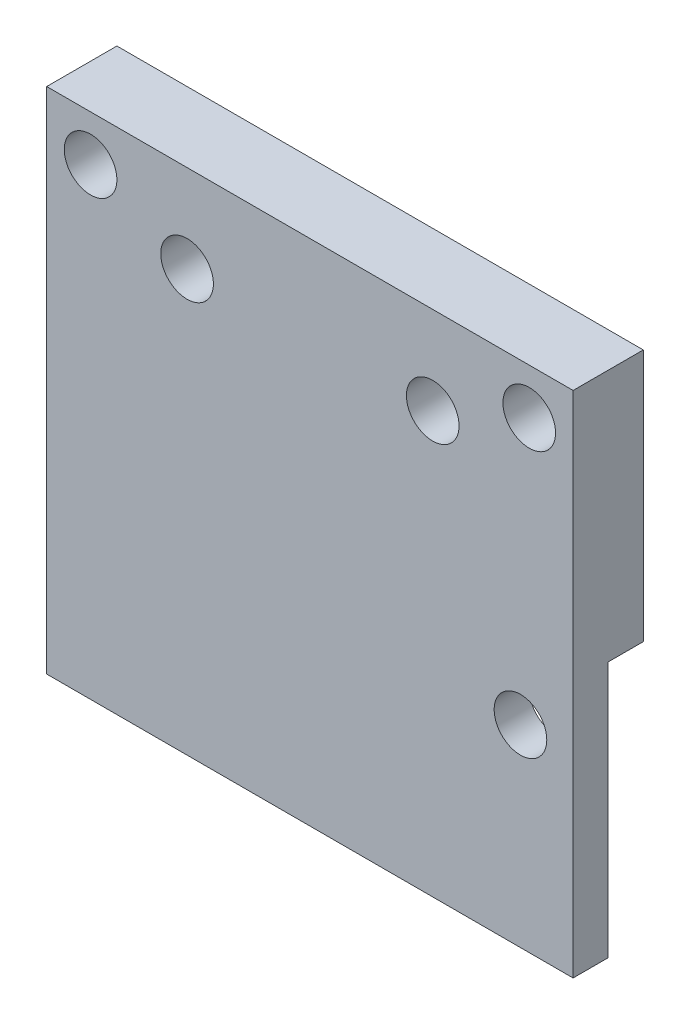
ISO-10303-21;
HEADER;
FILE_DESCRIPTION(('STEP AP214'),'2;1');
FILE_NAME('part.step','',(''),(''),'','','');
FILE_SCHEMA(('AUTOMOTIVE_DESIGN { 1 0 10303 214 1 1 1 1 }'));
ENDSEC;
DATA;
#1=APPLICATION_CONTEXT('core data for automotive mechanical design processes');
#2=APPLICATION_PROTOCOL_DEFINITION('international standard','automotive_design',2000,#1);
#3=PRODUCT_CONTEXT('',#1,'mechanical');
#4=PRODUCT('Part','Part','',(#3));
#5=PRODUCT_RELATED_PRODUCT_CATEGORY('part','',(#4));
#6=PRODUCT_DEFINITION_FORMATION('','',#4);
#7=PRODUCT_DEFINITION_CONTEXT('part definition',#1,'design');
#8=PRODUCT_DEFINITION('design','',#6,#7);
#9=PRODUCT_DEFINITION_SHAPE('','',#8);
#10=(LENGTH_UNIT() NAMED_UNIT(*) SI_UNIT(.MILLI.,.METRE.));
#11=(NAMED_UNIT(*) PLANE_ANGLE_UNIT() SI_UNIT($,.RADIAN.));
#12=(NAMED_UNIT(*) SI_UNIT($,.STERADIAN.) SOLID_ANGLE_UNIT());
#13=UNCERTAINTY_MEASURE_WITH_UNIT(LENGTH_MEASURE(1.E-05),#10,'distance_accuracy_value','');
#14=(GEOMETRIC_REPRESENTATION_CONTEXT(3) GLOBAL_UNCERTAINTY_ASSIGNED_CONTEXT((#13)) GLOBAL_UNIT_ASSIGNED_CONTEXT((#10,
#11,#12)) REPRESENTATION_CONTEXT('',''));
#15=CARTESIAN_POINT('',(0.,0.,0.));
#16=DIRECTION('',(0.,0.,1.));
#17=DIRECTION('',(1.,0.,0.));
#18=AXIS2_PLACEMENT_3D('',#15,#16,#17);
#19=CARTESIAN_POINT('',(0.,-6.5,4.));
#20=DIRECTION('',(0.,-1.,0.));
#21=DIRECTION('',(1.,0.,0.));
#22=AXIS2_PLACEMENT_3D('',#19,#20,#21);
#23=PLANE('',#22);
#24=DIRECTION('',(0.,0.,-1.));
#25=VECTOR('',#24,1.);
#26=CARTESIAN_POINT('',(-15.,-6.5,4.));
#27=LINE('',#26,#25);
#28=CARTESIAN_POINT('',(-15.,-6.5,4.));
#29=VERTEX_POINT('',#28);
#30=CARTESIAN_POINT('',(-15.,-6.5,2.));
#31=VERTEX_POINT('',#30);
#32=EDGE_CURVE('E59',#29,#31,#27,.T.);
#33=ORIENTED_EDGE('',*,*,#32,.T.);
#34=DIRECTION('',(-1.,0.,0.));
#35=VECTOR('',#34,1.);
#36=CARTESIAN_POINT('',(15.,-6.5,2.));
#37=LINE('',#36,#35);
#38=CARTESIAN_POINT('',(15.,-6.5,2.));
#39=VERTEX_POINT('',#38);
#40=EDGE_CURVE('E101',#39,#31,#37,.T.);
#41=ORIENTED_EDGE('',*,*,#40,.F.);
#42=DIRECTION('',(0.,0.,-1.));
#43=VECTOR('',#42,1.);
#44=CARTESIAN_POINT('',(15.,-6.5,4.));
#45=LINE('',#44,#43);
#46=CARTESIAN_POINT('',(15.,-6.5,4.));
#47=VERTEX_POINT('',#46);
#48=EDGE_CURVE('E11',#47,#39,#45,.T.);
#49=ORIENTED_EDGE('',*,*,#48,.F.);
#50=DIRECTION('',(-1.,0.,0.));
#51=VECTOR('',#50,1.);
#52=CARTESIAN_POINT('',(0.,-6.5,4.));
#53=LINE('',#52,#51);
#54=EDGE_CURVE('E118',#47,#29,#53,.T.);
#55=ORIENTED_EDGE('',*,*,#54,.T.);
#56=EDGE_LOOP('',(#33,#41,#49,#55));
#57=FACE_BOUND('',#56,.T.);
#58=ADVANCED_FACE('F35',(#57),#23,.T.);
#59=CARTESIAN_POINT('',(12.,4.5,4.));
#60=DIRECTION('',(0.,0.,-1.));
#61=DIRECTION('',(-1.,0.,0.));
#62=AXIS2_PLACEMENT_3D('',#59,#60,#61);
#63=CYLINDRICAL_SURFACE('',#62,1.5);
#64=CARTESIAN_POINT('',(12.,4.5,4.));
#65=DIRECTION('',(0.,0.,1.));
#66=DIRECTION('',(1.,0.,0.));
#67=AXIS2_PLACEMENT_3D('',#64,#65,#66);
#68=CIRCLE('',#67,1.5);
#69=CARTESIAN_POINT('',(13.5,4.5,4.));
#70=VERTEX_POINT('',#69);
#71=EDGE_CURVE('E123',#70,#70,#68,.T.);
#72=ORIENTED_EDGE('',*,*,#71,.T.);
#73=EDGE_LOOP('',(#72));
#74=FACE_BOUND('',#73,.T.);
#75=CARTESIAN_POINT('',(12.,4.5,2.));
#76=DIRECTION('',(0.,0.,-1.));
#77=DIRECTION('',(-1.,0.,0.));
#78=AXIS2_PLACEMENT_3D('',#75,#76,#77);
#79=CIRCLE('',#78,1.5);
#80=CARTESIAN_POINT('',(10.5,4.5,2.));
#81=VERTEX_POINT('',#80);
#82=EDGE_CURVE('E136',#81,#81,#79,.T.);
#83=ORIENTED_EDGE('',*,*,#82,.T.);
#84=EDGE_LOOP('',(#83));
#85=FACE_BOUND('',#84,.T.);
#86=ADVANCED_FACE('F186',(#74,#85),#63,.F.);
#87=CARTESIAN_POINT('',(15.,0.,4.));
#88=DIRECTION('',(-1.,0.,0.));
#89=DIRECTION('',(0.,-1.,0.));
#90=AXIS2_PLACEMENT_3D('',#87,#88,#89);
#91=PLANE('',#90);
#92=DIRECTION('',(0.,-1.,0.));
#93=VECTOR('',#92,1.);
#94=CARTESIAN_POINT('',(15.,8.1,2.));
#95=LINE('',#94,#93);
#96=CARTESIAN_POINT('',(15.,8.1,2.));
#97=VERTEX_POINT('',#96);
#98=EDGE_CURVE('E99',#97,#39,#95,.T.);
#99=ORIENTED_EDGE('',*,*,#98,.F.);
#100=DIRECTION('',(0.,0.,-1.));
#101=VECTOR('',#100,1.);
#102=CARTESIAN_POINT('',(15.,8.1,2.));
#103=LINE('',#102,#101);
#104=CARTESIAN_POINT('',(15.,8.1,0.));
#105=VERTEX_POINT('',#104);
#106=EDGE_CURVE('E158',#97,#105,#103,.T.);
#107=ORIENTED_EDGE('',*,*,#106,.T.);
#108=DIRECTION('',(0.,1.,0.));
#109=VECTOR('',#108,1.);
#110=CARTESIAN_POINT('',(15.,0.,0.));
#111=LINE('',#110,#109);
#112=CARTESIAN_POINT('',(15.,22.5,0.));
#113=VERTEX_POINT('',#112);
#114=EDGE_CURVE('E145',#105,#113,#111,.T.);
#115=ORIENTED_EDGE('',*,*,#114,.T.);
#116=DIRECTION('',(0.,0.,-1.));
#117=VECTOR('',#116,1.);
#118=CARTESIAN_POINT('',(15.,22.5,4.));
#119=LINE('',#118,#117);
#120=CARTESIAN_POINT('',(15.,22.5,4.));
#121=VERTEX_POINT('',#120);
#122=EDGE_CURVE('E43',#121,#113,#119,.T.);
#123=ORIENTED_EDGE('',*,*,#122,.F.);
#124=DIRECTION('',(0.,1.,0.));
#125=VECTOR('',#124,1.);
#126=CARTESIAN_POINT('',(15.,0.,4.));
#127=LINE('',#126,#125);
#128=EDGE_CURVE('E111',#47,#121,#127,.T.);
#129=ORIENTED_EDGE('',*,*,#128,.F.);
#130=ORIENTED_EDGE('',*,*,#48,.T.);
#131=EDGE_LOOP('',(#99,#107,#115,#123,#129,#130));
#132=FACE_BOUND('',#131,.T.);
#133=ADVANCED_FACE('F109',(#132),#91,.F.);
#134=CARTESIAN_POINT('',(0.,22.5,4.));
#135=DIRECTION('',(0.,1.,0.));
#136=DIRECTION('',(-1.,0.,0.));
#137=AXIS2_PLACEMENT_3D('',#134,#135,#136);
#138=PLANE('',#137);
#139=DIRECTION('',(1.,0.,0.));
#140=VECTOR('',#139,1.);
#141=CARTESIAN_POINT('',(0.,22.5,0.));
#142=LINE('',#141,#140);
#143=CARTESIAN_POINT('',(-15.,22.5,0.));
#144=VERTEX_POINT('',#143);
#145=EDGE_CURVE('E147',#144,#113,#142,.T.);
#146=ORIENTED_EDGE('',*,*,#145,.F.);
#147=DIRECTION('',(0.,0.,-1.));
#148=VECTOR('',#147,1.);
#149=CARTESIAN_POINT('',(-15.,22.5,4.));
#150=LINE('',#149,#148);
#151=CARTESIAN_POINT('',(-15.,22.5,4.));
#152=VERTEX_POINT('',#151);
#153=EDGE_CURVE('E152',#152,#144,#150,.T.);
#154=ORIENTED_EDGE('',*,*,#153,.F.);
#155=DIRECTION('',(1.,0.,0.));
#156=VECTOR('',#155,1.);
#157=CARTESIAN_POINT('',(0.,22.5,4.));
#158=LINE('',#157,#156);
#159=EDGE_CURVE('E117',#152,#121,#158,.T.);
#160=ORIENTED_EDGE('',*,*,#159,.T.);
#161=ORIENTED_EDGE('',*,*,#122,.T.);
#162=EDGE_LOOP('',(#146,#154,#160,#161));
#163=FACE_BOUND('',#162,.T.);
#164=ADVANCED_FACE('F155',(#163),#138,.T.);
#165=CARTESIAN_POINT('',(-12.5,19.8979157616564,4.));
#166=DIRECTION('',(0.,0.,-1.));
#167=DIRECTION('',(-1.,0.,0.));
#168=AXIS2_PLACEMENT_3D('',#165,#166,#167);
#169=CYLINDRICAL_SURFACE('',#168,1.5);
#170=CARTESIAN_POINT('',(-12.5,19.8979157616564,4.));
#171=DIRECTION('',(0.,0.,1.));
#172=DIRECTION('',(1.,0.,0.));
#173=AXIS2_PLACEMENT_3D('',#170,#171,#172);
#174=CIRCLE('',#173,1.5);
#175=CARTESIAN_POINT('',(-11.,19.8979157616564,4.));
#176=VERTEX_POINT('',#175);
#177=EDGE_CURVE('E126',#176,#176,#174,.T.);
#178=ORIENTED_EDGE('',*,*,#177,.T.);
#179=EDGE_LOOP('',(#178));
#180=FACE_BOUND('',#179,.T.);
#181=CARTESIAN_POINT('',(-12.5,19.8979157616564,0.));
#182=DIRECTION('',(0.,0.,1.));
#183=DIRECTION('',(1.,0.,0.));
#184=AXIS2_PLACEMENT_3D('',#181,#182,#183);
#185=CIRCLE('',#184,1.5);
#186=CARTESIAN_POINT('',(-11.,19.8979157616564,0.));
#187=VERTEX_POINT('',#186);
#188=EDGE_CURVE('E142',#187,#187,#185,.T.);
#189=ORIENTED_EDGE('',*,*,#188,.F.);
#190=EDGE_LOOP('',(#189));
#191=FACE_BOUND('',#190,.T.);
#192=ADVANCED_FACE('F176',(#180,#191),#169,.F.);
#193=CARTESIAN_POINT('',(12.5,19.8979157616564,4.));
#194=DIRECTION('',(0.,0.,-1.));
#195=DIRECTION('',(-1.,0.,0.));
#196=AXIS2_PLACEMENT_3D('',#193,#194,#195);
#197=CYLINDRICAL_SURFACE('',#196,1.5);
#198=CARTESIAN_POINT('',(12.5,19.8979157616564,4.));
#199=DIRECTION('',(0.,0.,1.));
#200=DIRECTION('',(1.,0.,0.));
#201=AXIS2_PLACEMENT_3D('',#198,#199,#200);
#202=CIRCLE('',#201,1.5);
#203=CARTESIAN_POINT('',(14.,19.8979157616564,4.));
#204=VERTEX_POINT('',#203);
#205=EDGE_CURVE('E171',#204,#204,#202,.T.);
#206=ORIENTED_EDGE('',*,*,#205,.T.);
#207=EDGE_LOOP('',(#206));
#208=FACE_BOUND('',#207,.T.);
#209=CARTESIAN_POINT('',(12.5,19.8979157616564,0.));
#210=DIRECTION('',(0.,0.,1.));
#211=DIRECTION('',(1.,0.,0.));
#212=AXIS2_PLACEMENT_3D('',#209,#210,#211);
#213=CIRCLE('',#212,1.5);
#214=CARTESIAN_POINT('',(14.,19.8979157616564,0.));
#215=VERTEX_POINT('',#214);
#216=EDGE_CURVE('E139',#215,#215,#213,.T.);
#217=ORIENTED_EDGE('',*,*,#216,.F.);
#218=EDGE_LOOP('',(#217));
#219=FACE_BOUND('',#218,.T.);
#220=ADVANCED_FACE('F208',(#208,#219),#197,.F.);
#221=CARTESIAN_POINT('',(-7.,17.5,4.));
#222=DIRECTION('',(0.,0.,-1.));
#223=DIRECTION('',(-1.,0.,0.));
#224=AXIS2_PLACEMENT_3D('',#221,#222,#223);
#225=CYLINDRICAL_SURFACE('',#224,1.5);
#226=CARTESIAN_POINT('',(-7.,17.5,4.));
#227=DIRECTION('',(0.,0.,1.));
#228=DIRECTION('',(1.,0.,0.));
#229=AXIS2_PLACEMENT_3D('',#226,#227,#228);
#230=CIRCLE('',#229,1.5);
#231=CARTESIAN_POINT('',(-5.5,17.5,4.));
#232=VERTEX_POINT('',#231);
#233=EDGE_CURVE('E168',#232,#232,#230,.T.);
#234=ORIENTED_EDGE('',*,*,#233,.T.);
#235=EDGE_LOOP('',(#234));
#236=FACE_BOUND('',#235,.T.);
#237=CARTESIAN_POINT('',(-7.,17.5,0.));
#238=DIRECTION('',(0.,0.,1.));
#239=DIRECTION('',(1.,0.,0.));
#240=AXIS2_PLACEMENT_3D('',#237,#238,#239);
#241=CIRCLE('',#240,1.5);
#242=CARTESIAN_POINT('',(-5.5,17.5,0.));
#243=VERTEX_POINT('',#242);
#244=EDGE_CURVE('E135',#243,#243,#241,.T.);
#245=ORIENTED_EDGE('',*,*,#244,.F.);
#246=EDGE_LOOP('',(#245));
#247=FACE_BOUND('',#246,.T.);
#248=ADVANCED_FACE('F210',(#236,#247),#225,.F.);
#249=CARTESIAN_POINT('',(7.,17.5,4.));
#250=DIRECTION('',(0.,0.,-1.));
#251=DIRECTION('',(-1.,0.,0.));
#252=AXIS2_PLACEMENT_3D('',#249,#250,#251);
#253=CYLINDRICAL_SURFACE('',#252,1.5);
#254=CARTESIAN_POINT('',(7.,17.5,4.));
#255=DIRECTION('',(0.,0.,1.));
#256=DIRECTION('',(1.,0.,0.));
#257=AXIS2_PLACEMENT_3D('',#254,#255,#256);
#258=CIRCLE('',#257,1.5);
#259=CARTESIAN_POINT('',(8.5,17.5,4.));
#260=VERTEX_POINT('',#259);
#261=EDGE_CURVE('E150',#260,#260,#258,.T.);
#262=ORIENTED_EDGE('',*,*,#261,.T.);
#263=EDGE_LOOP('',(#262));
#264=FACE_BOUND('',#263,.T.);
#265=CARTESIAN_POINT('',(7.,17.5,0.));
#266=DIRECTION('',(0.,0.,1.));
#267=DIRECTION('',(1.,0.,0.));
#268=AXIS2_PLACEMENT_3D('',#265,#266,#267);
#269=CIRCLE('',#268,1.5);
#270=CARTESIAN_POINT('',(8.5,17.5,0.));
#271=VERTEX_POINT('',#270);
#272=EDGE_CURVE('E132',#271,#271,#269,.T.);
#273=ORIENTED_EDGE('',*,*,#272,.F.);
#274=EDGE_LOOP('',(#273));
#275=FACE_BOUND('',#274,.T.);
#276=ADVANCED_FACE('F37',(#264,#275),#253,.F.);
#277=CARTESIAN_POINT('',(-15.,0.,4.));
#278=DIRECTION('',(-1.,0.,0.));
#279=DIRECTION('',(0.,-1.,0.));
#280=AXIS2_PLACEMENT_3D('',#277,#278,#279);
#281=PLANE('',#280);
#282=DIRECTION('',(0.,0.,-1.));
#283=VECTOR('',#282,1.);
#284=CARTESIAN_POINT('',(-15.,8.1,2.));
#285=LINE('',#284,#283);
#286=CARTESIAN_POINT('',(-15.,8.1,2.));
#287=VERTEX_POINT('',#286);
#288=CARTESIAN_POINT('',(-15.,8.1,0.));
#289=VERTEX_POINT('',#288);
#290=EDGE_CURVE('E50',#287,#289,#285,.T.);
#291=ORIENTED_EDGE('',*,*,#290,.F.);
#292=DIRECTION('',(0.,1.,0.));
#293=VECTOR('',#292,1.);
#294=CARTESIAN_POINT('',(-15.,8.1,2.));
#295=LINE('',#294,#293);
#296=EDGE_CURVE('E107',#31,#287,#295,.T.);
#297=ORIENTED_EDGE('',*,*,#296,.F.);
#298=ORIENTED_EDGE('',*,*,#32,.F.);
#299=DIRECTION('',(0.,1.,0.));
#300=VECTOR('',#299,1.);
#301=CARTESIAN_POINT('',(-15.,0.,4.));
#302=LINE('',#301,#300);
#303=EDGE_CURVE('E122',#29,#152,#302,.T.);
#304=ORIENTED_EDGE('',*,*,#303,.T.);
#305=ORIENTED_EDGE('',*,*,#153,.T.);
#306=DIRECTION('',(0.,1.,0.));
#307=VECTOR('',#306,1.);
#308=CARTESIAN_POINT('',(-15.,0.,0.));
#309=LINE('',#308,#307);
#310=EDGE_CURVE('E75',#289,#144,#309,.T.);
#311=ORIENTED_EDGE('',*,*,#310,.F.);
#312=EDGE_LOOP('',(#291,#297,#298,#304,#305,#311));
#313=FACE_BOUND('',#312,.T.);
#314=ADVANCED_FACE('F181',(#313),#281,.T.);
#315=CARTESIAN_POINT('',(0.,0.,4.));
#316=DIRECTION('',(0.,0.,1.));
#317=DIRECTION('',(1.,0.,0.));
#318=AXIS2_PLACEMENT_3D('',#315,#316,#317);
#319=PLANE('',#318);
#320=ORIENTED_EDGE('',*,*,#261,.F.);
#321=EDGE_LOOP('',(#320));
#322=FACE_BOUND('',#321,.T.);
#323=ORIENTED_EDGE('',*,*,#233,.F.);
#324=EDGE_LOOP('',(#323));
#325=FACE_BOUND('',#324,.T.);
#326=ORIENTED_EDGE('',*,*,#205,.F.);
#327=EDGE_LOOP('',(#326));
#328=FACE_BOUND('',#327,.T.);
#329=ORIENTED_EDGE('',*,*,#177,.F.);
#330=EDGE_LOOP('',(#329));
#331=FACE_BOUND('',#330,.T.);
#332=ORIENTED_EDGE('',*,*,#71,.F.);
#333=EDGE_LOOP('',(#332));
#334=FACE_BOUND('',#333,.T.);
#335=ORIENTED_EDGE('',*,*,#54,.F.);
#336=ORIENTED_EDGE('',*,*,#128,.T.);
#337=ORIENTED_EDGE('',*,*,#159,.F.);
#338=ORIENTED_EDGE('',*,*,#303,.F.);
#339=EDGE_LOOP('',(#335,#336,#337,#338));
#340=FACE_BOUND('',#339,.T.);
#341=ADVANCED_FACE('F121',(#322,#325,#328,#331,#334,#340),#319,.T.);
#342=CARTESIAN_POINT('',(0.,0.,0.));
#343=DIRECTION('',(0.,0.,1.));
#344=DIRECTION('',(1.,0.,0.));
#345=AXIS2_PLACEMENT_3D('',#342,#343,#344);
#346=PLANE('',#345);
#347=ORIENTED_EDGE('',*,*,#272,.T.);
#348=EDGE_LOOP('',(#347));
#349=FACE_BOUND('',#348,.T.);
#350=ORIENTED_EDGE('',*,*,#244,.T.);
#351=EDGE_LOOP('',(#350));
#352=FACE_BOUND('',#351,.T.);
#353=ORIENTED_EDGE('',*,*,#216,.T.);
#354=EDGE_LOOP('',(#353));
#355=FACE_BOUND('',#354,.T.);
#356=ORIENTED_EDGE('',*,*,#188,.T.);
#357=EDGE_LOOP('',(#356));
#358=FACE_BOUND('',#357,.T.);
#359=ORIENTED_EDGE('',*,*,#114,.F.);
#360=DIRECTION('',(1.,0.,0.));
#361=VECTOR('',#360,1.);
#362=CARTESIAN_POINT('',(15.,8.1,0.));
#363=LINE('',#362,#361);
#364=EDGE_CURVE('E105',#289,#105,#363,.T.);
#365=ORIENTED_EDGE('',*,*,#364,.F.);
#366=ORIENTED_EDGE('',*,*,#310,.T.);
#367=ORIENTED_EDGE('',*,*,#145,.T.);
#368=EDGE_LOOP('',(#359,#365,#366,#367));
#369=FACE_BOUND('',#368,.T.);
#370=ADVANCED_FACE('F157',(#349,#352,#355,#358,#369),#346,.F.);
#371=CARTESIAN_POINT('',(15.,8.1,2.));
#372=DIRECTION('',(0.,1.,0.));
#373=DIRECTION('',(0.,0.,1.));
#374=AXIS2_PLACEMENT_3D('',#371,#372,#373);
#375=PLANE('',#374);
#376=ORIENTED_EDGE('',*,*,#364,.T.);
#377=ORIENTED_EDGE('',*,*,#106,.F.);
#378=DIRECTION('',(1.,0.,0.));
#379=VECTOR('',#378,1.);
#380=CARTESIAN_POINT('',(15.,8.1,2.));
#381=LINE('',#380,#379);
#382=EDGE_CURVE('E102',#287,#97,#381,.T.);
#383=ORIENTED_EDGE('',*,*,#382,.F.);
#384=ORIENTED_EDGE('',*,*,#290,.T.);
#385=EDGE_LOOP('',(#376,#377,#383,#384));
#386=FACE_BOUND('',#385,.T.);
#387=ADVANCED_FACE('F193',(#386),#375,.F.);
#388=CARTESIAN_POINT('',(0.,0.,2.));
#389=DIRECTION('',(0.,0.,-1.));
#390=DIRECTION('',(-1.,0.,0.));
#391=AXIS2_PLACEMENT_3D('',#388,#389,#390);
#392=PLANE('',#391);
#393=ORIENTED_EDGE('',*,*,#82,.F.);
#394=EDGE_LOOP('',(#393));
#395=FACE_BOUND('',#394,.T.);
#396=ORIENTED_EDGE('',*,*,#98,.T.);
#397=ORIENTED_EDGE('',*,*,#40,.T.);
#398=ORIENTED_EDGE('',*,*,#296,.T.);
#399=ORIENTED_EDGE('',*,*,#382,.T.);
#400=EDGE_LOOP('',(#396,#397,#398,#399));
#401=FACE_BOUND('',#400,.T.);
#402=ADVANCED_FACE('F100',(#395,#401),#392,.T.);
#403=CLOSED_SHELL('',(#58,#86,#133,#164,#192,#220,#248,#276,#314,#341,#370,#387,#402));
#404=MANIFOLD_SOLID_BREP('B2',#403);
#405=ADVANCED_BREP_SHAPE_REPRESENTATION('',(#18,#404),#14);
#406=SHAPE_DEFINITION_REPRESENTATION(#9,#405);
ENDSEC;
END-ISO-10303-21;
